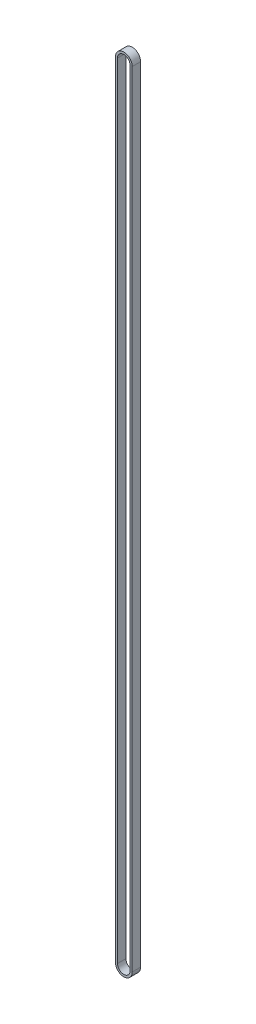
ISO-10303-21;
HEADER;
FILE_DESCRIPTION(('STEP AP214'),'2;1');
FILE_NAME('part.step','',(''),(''),'','','');
FILE_SCHEMA(('AUTOMOTIVE_DESIGN { 1 0 10303 214 1 1 1 1 }'));
ENDSEC;
DATA;
#1=APPLICATION_CONTEXT('core data for automotive mechanical design processes');
#2=APPLICATION_PROTOCOL_DEFINITION('international standard','automotive_design',2000,#1);
#3=PRODUCT_CONTEXT('',#1,'mechanical');
#4=PRODUCT('Part','Part','',(#3));
#5=PRODUCT_RELATED_PRODUCT_CATEGORY('part','',(#4));
#6=PRODUCT_DEFINITION_FORMATION('','',#4);
#7=PRODUCT_DEFINITION_CONTEXT('part definition',#1,'design');
#8=PRODUCT_DEFINITION('design','',#6,#7);
#9=PRODUCT_DEFINITION_SHAPE('','',#8);
#10=(LENGTH_UNIT() NAMED_UNIT(*) SI_UNIT(.MILLI.,.METRE.));
#11=(NAMED_UNIT(*) PLANE_ANGLE_UNIT() SI_UNIT($,.RADIAN.));
#12=(NAMED_UNIT(*) SI_UNIT($,.STERADIAN.) SOLID_ANGLE_UNIT());
#13=UNCERTAINTY_MEASURE_WITH_UNIT(LENGTH_MEASURE(1.E-05),#10,'distance_accuracy_value','');
#14=(GEOMETRIC_REPRESENTATION_CONTEXT(3) GLOBAL_UNCERTAINTY_ASSIGNED_CONTEXT((#13)) GLOBAL_UNIT_ASSIGNED_CONTEXT((#10,
#11,#12)) REPRESENTATION_CONTEXT('',''));
#15=CARTESIAN_POINT('',(0.,0.,0.));
#16=DIRECTION('',(0.,0.,1.));
#17=DIRECTION('',(1.,0.,0.));
#18=AXIS2_PLACEMENT_3D('',#15,#16,#17);
#19=CARTESIAN_POINT('',(-4.50000000000019,0.,6.));
#20=DIRECTION('',(1.,0.,0.));
#21=DIRECTION('',(0.,1.,0.));
#22=AXIS2_PLACEMENT_3D('',#19,#20,#21);
#23=PLANE('',#22);
#24=DIRECTION('',(0.,1.,0.));
#25=VECTOR('',#24,1.);
#26=CARTESIAN_POINT('',(-4.50000000000019,0.,0.));
#27=LINE('',#26,#25);
#28=CARTESIAN_POINT('',(-4.50000000000019,0.,0.));
#29=VERTEX_POINT('',#28);
#30=CARTESIAN_POINT('',(-4.5000000000001,560.,0.));
#31=VERTEX_POINT('',#30);
#32=EDGE_CURVE('E84',#29,#31,#27,.T.);
#33=ORIENTED_EDGE('',*,*,#32,.T.);
#34=DIRECTION('',(0.,0.,-1.));
#35=VECTOR('',#34,1.);
#36=CARTESIAN_POINT('',(-4.5,560.,6.));
#37=LINE('',#36,#35);
#38=CARTESIAN_POINT('',(-4.5000000000001,560.,6.));
#39=VERTEX_POINT('',#38);
#40=EDGE_CURVE('E168',#31,#39,#37,.F.);
#41=ORIENTED_EDGE('',*,*,#40,.T.);
#42=DIRECTION('',(0.,1.,0.));
#43=VECTOR('',#42,1.);
#44=CARTESIAN_POINT('',(-4.50000000000019,0.,6.));
#45=LINE('',#44,#43);
#46=CARTESIAN_POINT('',(-4.50000000000019,0.,6.));
#47=VERTEX_POINT('',#46);
#48=EDGE_CURVE('E85',#47,#39,#45,.T.);
#49=ORIENTED_EDGE('',*,*,#48,.F.);
#50=DIRECTION('',(0.,0.,-1.));
#51=VECTOR('',#50,1.);
#52=CARTESIAN_POINT('',(-4.50000000000019,0.,6.));
#53=LINE('',#52,#51);
#54=EDGE_CURVE('E81',#47,#29,#53,.T.);
#55=ORIENTED_EDGE('',*,*,#54,.T.);
#56=EDGE_LOOP('',(#33,#41,#49,#55));
#57=FACE_BOUND('',#56,.T.);
#58=ADVANCED_FACE('F17',(#57),#23,.T.);
#59=CARTESIAN_POINT('',(0.,560.,6.));
#60=DIRECTION('',(0.,0.,-1.));
#61=DIRECTION('',(-1.,0.,0.));
#62=AXIS2_PLACEMENT_3D('',#59,#60,#61);
#63=CYLINDRICAL_SURFACE('',#62,4.5);
#64=CARTESIAN_POINT('',(0.,560.,6.));
#65=DIRECTION('',(0.,0.,-1.));
#66=DIRECTION('',(-1.,0.,0.));
#67=AXIS2_PLACEMENT_3D('',#64,#65,#66);
#68=CIRCLE('',#67,4.5);
#69=CARTESIAN_POINT('',(4.5,560.,6.));
#70=VERTEX_POINT('',#69);
#71=EDGE_CURVE('E150',#39,#70,#68,.T.);
#72=ORIENTED_EDGE('',*,*,#71,.F.);
#73=ORIENTED_EDGE('',*,*,#40,.F.);
#74=CARTESIAN_POINT('',(0.,560.,0.));
#75=DIRECTION('',(0.,0.,-1.));
#76=DIRECTION('',(-1.,0.,0.));
#77=AXIS2_PLACEMENT_3D('',#74,#75,#76);
#78=CIRCLE('',#77,4.5);
#79=CARTESIAN_POINT('',(4.5,560.,0.));
#80=VERTEX_POINT('',#79);
#81=EDGE_CURVE('E94',#31,#80,#78,.T.);
#82=ORIENTED_EDGE('',*,*,#81,.T.);
#83=DIRECTION('',(0.,0.,1.));
#84=VECTOR('',#83,1.);
#85=CARTESIAN_POINT('',(4.5,560.,6.));
#86=LINE('',#85,#84);
#87=EDGE_CURVE('E165',#70,#80,#86,.F.);
#88=ORIENTED_EDGE('',*,*,#87,.F.);
#89=EDGE_LOOP('',(#72,#73,#82,#88));
#90=FACE_BOUND('',#89,.T.);
#91=ADVANCED_FACE('F109',(#90),#63,.F.);
#92=CARTESIAN_POINT('',(4.5,560.,6.));
#93=DIRECTION('',(-1.,0.,0.));
#94=DIRECTION('',(0.,-1.,0.));
#95=AXIS2_PLACEMENT_3D('',#92,#93,#94);
#96=PLANE('',#95);
#97=DIRECTION('',(0.,1.,0.));
#98=VECTOR('',#97,1.);
#99=CARTESIAN_POINT('',(4.5,0.,0.));
#100=LINE('',#99,#98);
#101=CARTESIAN_POINT('',(4.5000000000001,0.,0.));
#102=VERTEX_POINT('',#101);
#103=EDGE_CURVE('E155',#80,#102,#100,.F.);
#104=ORIENTED_EDGE('',*,*,#103,.T.);
#105=DIRECTION('',(0.,0.,-1.));
#106=VECTOR('',#105,1.);
#107=CARTESIAN_POINT('',(4.50000000000019,0.,6.));
#108=LINE('',#107,#106);
#109=CARTESIAN_POINT('',(4.5000000000001,0.,6.));
#110=VERTEX_POINT('',#109);
#111=EDGE_CURVE('E75',#102,#110,#108,.F.);
#112=ORIENTED_EDGE('',*,*,#111,.T.);
#113=DIRECTION('',(0.,1.,0.));
#114=VECTOR('',#113,1.);
#115=CARTESIAN_POINT('',(4.5,0.,6.));
#116=LINE('',#115,#114);
#117=EDGE_CURVE('E174',#70,#110,#116,.F.);
#118=ORIENTED_EDGE('',*,*,#117,.F.);
#119=ORIENTED_EDGE('',*,*,#87,.T.);
#120=EDGE_LOOP('',(#104,#112,#118,#119));
#121=FACE_BOUND('',#120,.T.);
#122=ADVANCED_FACE('F100',(#121),#96,.T.);
#123=CARTESIAN_POINT('',(0.,0.,6.));
#124=DIRECTION('',(0.,0.,-1.));
#125=DIRECTION('',(-1.,0.,0.));
#126=AXIS2_PLACEMENT_3D('',#123,#124,#125);
#127=CYLINDRICAL_SURFACE('',#126,4.50000000000019);
#128=CARTESIAN_POINT('',(0.,0.,6.));
#129=DIRECTION('',(0.,0.,-1.));
#130=DIRECTION('',(-1.,0.,0.));
#131=AXIS2_PLACEMENT_3D('',#128,#129,#130);
#132=CIRCLE('',#131,4.50000000000019);
#133=EDGE_CURVE('E97',#110,#47,#132,.T.);
#134=ORIENTED_EDGE('',*,*,#133,.F.);
#135=ORIENTED_EDGE('',*,*,#111,.F.);
#136=CARTESIAN_POINT('',(0.,0.,0.));
#137=DIRECTION('',(0.,0.,-1.));
#138=DIRECTION('',(-1.,0.,0.));
#139=AXIS2_PLACEMENT_3D('',#136,#137,#138);
#140=CIRCLE('',#139,4.50000000000019);
#141=EDGE_CURVE('E20',#102,#29,#140,.T.);
#142=ORIENTED_EDGE('',*,*,#141,.T.);
#143=ORIENTED_EDGE('',*,*,#54,.F.);
#144=EDGE_LOOP('',(#134,#135,#142,#143));
#145=FACE_BOUND('',#144,.T.);
#146=ADVANCED_FACE('F96',(#145),#127,.F.);
#147=CARTESIAN_POINT('',(6.,560.,6.));
#148=DIRECTION('',(-1.,0.,0.));
#149=DIRECTION('',(0.,0.,1.));
#150=AXIS2_PLACEMENT_3D('',#147,#148,#149);
#151=PLANE('',#150);
#152=DIRECTION('',(0.,1.,0.));
#153=VECTOR('',#152,1.);
#154=CARTESIAN_POINT('',(6.,0.,6.));
#155=LINE('',#154,#153);
#156=CARTESIAN_POINT('',(6.00000000000005,0.,6.));
#157=VERTEX_POINT('',#156);
#158=CARTESIAN_POINT('',(6.00000000000005,560.,6.));
#159=VERTEX_POINT('',#158);
#160=EDGE_CURVE('E172',#157,#159,#155,.T.);
#161=ORIENTED_EDGE('',*,*,#160,.F.);
#162=DIRECTION('',(0.,0.,-1.));
#163=VECTOR('',#162,1.);
#164=CARTESIAN_POINT('',(6.0000000000001,0.,6.));
#165=LINE('',#164,#163);
#166=CARTESIAN_POINT('',(6.00000000000005,0.,0.));
#167=VERTEX_POINT('',#166);
#168=EDGE_CURVE('E162',#167,#157,#165,.F.);
#169=ORIENTED_EDGE('',*,*,#168,.F.);
#170=DIRECTION('',(0.,1.,0.));
#171=VECTOR('',#170,1.);
#172=CARTESIAN_POINT('',(6.,0.,0.));
#173=LINE('',#172,#171);
#174=CARTESIAN_POINT('',(6.00000000000005,560.,0.));
#175=VERTEX_POINT('',#174);
#176=EDGE_CURVE('E142',#167,#175,#173,.T.);
#177=ORIENTED_EDGE('',*,*,#176,.T.);
#178=DIRECTION('',(0.,0.,-1.));
#179=VECTOR('',#178,1.);
#180=CARTESIAN_POINT('',(6.0000000000001,560.,6.));
#181=LINE('',#180,#179);
#182=EDGE_CURVE('E148',#159,#175,#181,.T.);
#183=ORIENTED_EDGE('',*,*,#182,.F.);
#184=EDGE_LOOP('',(#161,#169,#177,#183));
#185=FACE_BOUND('',#184,.T.);
#186=ADVANCED_FACE('F99',(#185),#151,.F.);
#187=CARTESIAN_POINT('',(0.,0.,0.));
#188=DIRECTION('',(0.,0.,1.));
#189=DIRECTION('',(1.,0.,0.));
#190=AXIS2_PLACEMENT_3D('',#187,#188,#189);
#191=PLANE('',#190);
#192=CARTESIAN_POINT('',(0.,560.,0.));
#193=DIRECTION('',(0.,0.,-1.));
#194=DIRECTION('',(-1.,0.,0.));
#195=AXIS2_PLACEMENT_3D('',#192,#193,#194);
#196=CIRCLE('',#195,6.0000000000001);
#197=CARTESIAN_POINT('',(-6.00000000000019,560.,0.));
#198=VERTEX_POINT('',#197);
#199=EDGE_CURVE('E138',#175,#198,#196,.F.);
#200=ORIENTED_EDGE('',*,*,#199,.F.);
#201=ORIENTED_EDGE('',*,*,#176,.F.);
#202=CARTESIAN_POINT('',(0.,0.,0.));
#203=DIRECTION('',(0.,0.,-1.));
#204=DIRECTION('',(-1.,0.,0.));
#205=AXIS2_PLACEMENT_3D('',#202,#203,#204);
#206=CIRCLE('',#205,6.0000000000001);
#207=CARTESIAN_POINT('',(-6.00000000000019,0.,0.));
#208=VERTEX_POINT('',#207);
#209=EDGE_CURVE('E163',#208,#167,#206,.F.);
#210=ORIENTED_EDGE('',*,*,#209,.F.);
#211=DIRECTION('',(0.,1.,0.));
#212=VECTOR('',#211,1.);
#213=CARTESIAN_POINT('',(-6.00000000000019,0.,0.));
#214=LINE('',#213,#212);
#215=EDGE_CURVE('E145',#208,#198,#214,.T.);
#216=ORIENTED_EDGE('',*,*,#215,.T.);
#217=EDGE_LOOP('',(#200,#201,#210,#216));
#218=FACE_BOUND('',#217,.T.);
#219=ORIENTED_EDGE('',*,*,#81,.F.);
#220=ORIENTED_EDGE('',*,*,#32,.F.);
#221=ORIENTED_EDGE('',*,*,#141,.F.);
#222=ORIENTED_EDGE('',*,*,#103,.F.);
#223=EDGE_LOOP('',(#219,#220,#221,#222));
#224=FACE_BOUND('',#223,.T.);
#225=ADVANCED_FACE('F90',(#218,#224),#191,.F.);
#226=CARTESIAN_POINT('',(0.,560.,6.));
#227=DIRECTION('',(0.,0.,-1.));
#228=DIRECTION('',(-1.,0.,0.));
#229=AXIS2_PLACEMENT_3D('',#226,#227,#228);
#230=CYLINDRICAL_SURFACE('',#229,6.0000000000001);
#231=ORIENTED_EDGE('',*,*,#199,.T.);
#232=DIRECTION('',(0.,0.,-1.));
#233=VECTOR('',#232,1.);
#234=CARTESIAN_POINT('',(-6.00000000000019,560.,6.));
#235=LINE('',#234,#233);
#236=CARTESIAN_POINT('',(-6.00000000000019,560.,6.));
#237=VERTEX_POINT('',#236);
#238=EDGE_CURVE('E180',#198,#237,#235,.F.);
#239=ORIENTED_EDGE('',*,*,#238,.T.);
#240=CARTESIAN_POINT('',(0.,560.,6.));
#241=DIRECTION('',(0.,0.,-1.));
#242=DIRECTION('',(-1.,0.,0.));
#243=AXIS2_PLACEMENT_3D('',#240,#241,#242);
#244=CIRCLE('',#243,6.0000000000001);
#245=EDGE_CURVE('E173',#159,#237,#244,.F.);
#246=ORIENTED_EDGE('',*,*,#245,.F.);
#247=ORIENTED_EDGE('',*,*,#182,.T.);
#248=EDGE_LOOP('',(#231,#239,#246,#247));
#249=FACE_BOUND('',#248,.T.);
#250=ADVANCED_FACE('F126',(#249),#230,.T.);
#251=CARTESIAN_POINT('',(0.,0.,6.));
#252=DIRECTION('',(0.,0.,1.));
#253=DIRECTION('',(1.,0.,0.));
#254=AXIS2_PLACEMENT_3D('',#251,#252,#253);
#255=PLANE('',#254);
#256=CARTESIAN_POINT('',(0.,0.,6.));
#257=DIRECTION('',(0.,0.,-1.));
#258=DIRECTION('',(-1.,0.,0.));
#259=AXIS2_PLACEMENT_3D('',#256,#257,#258);
#260=CIRCLE('',#259,6.0000000000001);
#261=CARTESIAN_POINT('',(-6.00000000000019,0.,6.));
#262=VERTEX_POINT('',#261);
#263=EDGE_CURVE('E34',#157,#262,#260,.T.);
#264=ORIENTED_EDGE('',*,*,#263,.F.);
#265=ORIENTED_EDGE('',*,*,#160,.T.);
#266=ORIENTED_EDGE('',*,*,#245,.T.);
#267=DIRECTION('',(0.,1.,0.));
#268=VECTOR('',#267,1.);
#269=CARTESIAN_POINT('',(-6.00000000000019,0.,6.));
#270=LINE('',#269,#268);
#271=EDGE_CURVE('E26',#237,#262,#270,.F.);
#272=ORIENTED_EDGE('',*,*,#271,.T.);
#273=EDGE_LOOP('',(#264,#265,#266,#272));
#274=FACE_BOUND('',#273,.T.);
#275=ORIENTED_EDGE('',*,*,#117,.T.);
#276=ORIENTED_EDGE('',*,*,#133,.T.);
#277=ORIENTED_EDGE('',*,*,#48,.T.);
#278=ORIENTED_EDGE('',*,*,#71,.T.);
#279=EDGE_LOOP('',(#275,#276,#277,#278));
#280=FACE_BOUND('',#279,.T.);
#281=ADVANCED_FACE('F120',(#274,#280),#255,.T.);
#282=CARTESIAN_POINT('',(0.,0.,6.));
#283=DIRECTION('',(0.,0.,-1.));
#284=DIRECTION('',(-1.,0.,0.));
#285=AXIS2_PLACEMENT_3D('',#282,#283,#284);
#286=CYLINDRICAL_SURFACE('',#285,6.0000000000001);
#287=ORIENTED_EDGE('',*,*,#209,.T.);
#288=ORIENTED_EDGE('',*,*,#168,.T.);
#289=ORIENTED_EDGE('',*,*,#263,.T.);
#290=DIRECTION('',(0.,0.,-1.));
#291=VECTOR('',#290,1.);
#292=CARTESIAN_POINT('',(-6.00000000000019,0.,6.));
#293=LINE('',#292,#291);
#294=EDGE_CURVE('E11',#262,#208,#293,.T.);
#295=ORIENTED_EDGE('',*,*,#294,.T.);
#296=EDGE_LOOP('',(#287,#288,#289,#295));
#297=FACE_BOUND('',#296,.T.);
#298=ADVANCED_FACE('F114',(#297),#286,.T.);
#299=CARTESIAN_POINT('',(-6.00000000000019,0.,6.));
#300=DIRECTION('',(1.,0.,0.));
#301=DIRECTION('',(0.,0.,-1.));
#302=AXIS2_PLACEMENT_3D('',#299,#300,#301);
#303=PLANE('',#302);
#304=ORIENTED_EDGE('',*,*,#271,.F.);
#305=ORIENTED_EDGE('',*,*,#238,.F.);
#306=ORIENTED_EDGE('',*,*,#215,.F.);
#307=ORIENTED_EDGE('',*,*,#294,.F.);
#308=EDGE_LOOP('',(#304,#305,#306,#307));
#309=FACE_BOUND('',#308,.T.);
#310=ADVANCED_FACE('F112',(#309),#303,.F.);
#311=CLOSED_SHELL('',(#58,#91,#122,#146,#186,#225,#250,#281,#298,#310));
#312=MANIFOLD_SOLID_BREP('B1',#311);
#313=ADVANCED_BREP_SHAPE_REPRESENTATION('',(#18,#312),#14);
#314=SHAPE_DEFINITION_REPRESENTATION(#9,#313);
ENDSEC;
END-ISO-10303-21;
